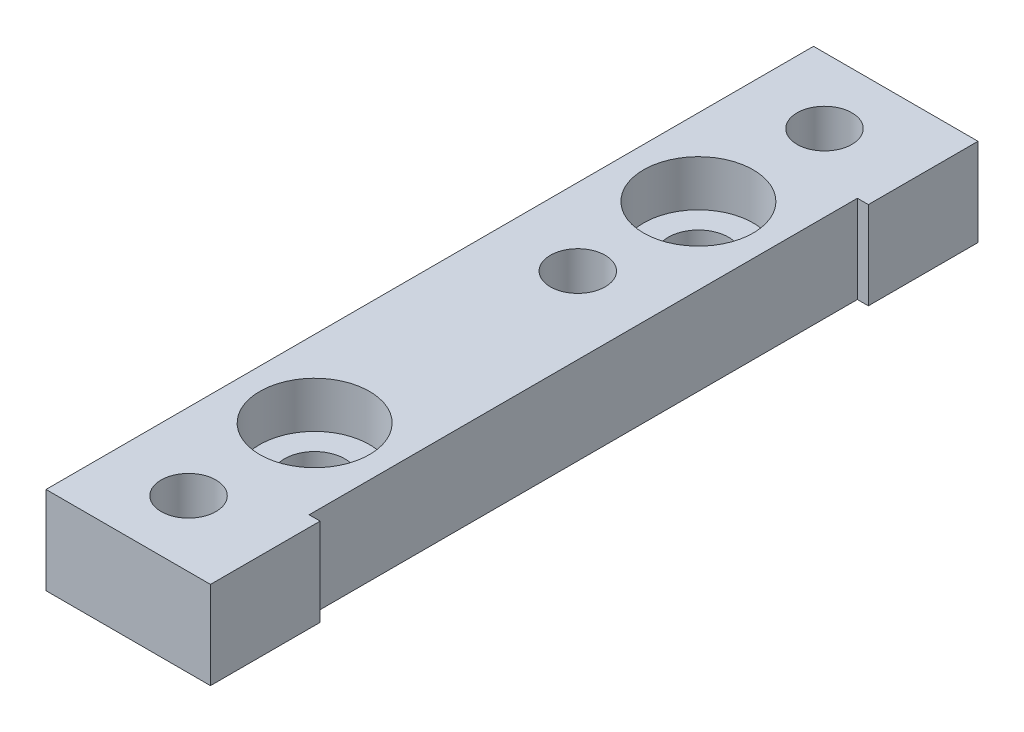
ISO-10303-21;
HEADER;
FILE_DESCRIPTION(('STEP AP214'),'2;1');
FILE_NAME('part.step','',(''),(''),'','','');
FILE_SCHEMA(('AUTOMOTIVE_DESIGN { 1 0 10303 214 1 1 1 1 }'));
ENDSEC;
DATA;
#1=APPLICATION_CONTEXT('core data for automotive mechanical design processes');
#2=APPLICATION_PROTOCOL_DEFINITION('international standard','automotive_design',2000,#1);
#3=PRODUCT_CONTEXT('',#1,'mechanical');
#4=PRODUCT('Part','Part','',(#3));
#5=PRODUCT_RELATED_PRODUCT_CATEGORY('part','',(#4));
#6=PRODUCT_DEFINITION_FORMATION('','',#4);
#7=PRODUCT_DEFINITION_CONTEXT('part definition',#1,'design');
#8=PRODUCT_DEFINITION('design','',#6,#7);
#9=PRODUCT_DEFINITION_SHAPE('','',#8);
#10=(LENGTH_UNIT() NAMED_UNIT(*) SI_UNIT(.MILLI.,.METRE.));
#11=(NAMED_UNIT(*) PLANE_ANGLE_UNIT() SI_UNIT($,.RADIAN.));
#12=(NAMED_UNIT(*) SI_UNIT($,.STERADIAN.) SOLID_ANGLE_UNIT());
#13=UNCERTAINTY_MEASURE_WITH_UNIT(LENGTH_MEASURE(1.E-05),#10,'distance_accuracy_value','');
#14=(GEOMETRIC_REPRESENTATION_CONTEXT(3) GLOBAL_UNCERTAINTY_ASSIGNED_CONTEXT((#13)) GLOBAL_UNIT_ASSIGNED_CONTEXT((#10,
#11,#12)) REPRESENTATION_CONTEXT('',''));
#15=CARTESIAN_POINT('',(0.,0.,0.));
#16=DIRECTION('',(0.,0.,1.));
#17=DIRECTION('',(1.,0.,0.));
#18=AXIS2_PLACEMENT_3D('',#15,#16,#17);
#19=CARTESIAN_POINT('',(-0.500000000000005,0.,-17.5));
#20=DIRECTION('',(0.,1.,0.));
#21=DIRECTION('',(0.,0.,1.));
#22=AXIS2_PLACEMENT_3D('',#19,#20,#21);
#23=CYLINDRICAL_SURFACE('',#22,2.75);
#24=CARTESIAN_POINT('',(-0.500000000000005,0.,-17.5));
#25=DIRECTION('',(0.,1.,0.));
#26=DIRECTION('',(0.,0.,1.));
#27=AXIS2_PLACEMENT_3D('',#24,#25,#26);
#28=CIRCLE('',#27,2.75);
#29=CARTESIAN_POINT('',(-0.500000000000005,0.,-14.75));
#30=VERTEX_POINT('',#29);
#31=EDGE_CURVE('E153',#30,#30,#28,.T.);
#32=ORIENTED_EDGE('',*,*,#31,.F.);
#33=EDGE_LOOP('',(#32));
#34=FACE_BOUND('',#33,.T.);
#35=CARTESIAN_POINT('',(-0.500000000000005,3.8,-17.5));
#36=DIRECTION('',(0.,1.,0.));
#37=DIRECTION('',(0.,0.,1.));
#38=AXIS2_PLACEMENT_3D('',#35,#36,#37);
#39=CIRCLE('',#38,2.75);
#40=CARTESIAN_POINT('',(-0.500000000000005,3.8,-14.75));
#41=VERTEX_POINT('',#40);
#42=EDGE_CURVE('E150',#41,#41,#39,.F.);
#43=ORIENTED_EDGE('',*,*,#42,.F.);
#44=EDGE_LOOP('',(#43));
#45=FACE_BOUND('',#44,.T.);
#46=ADVANCED_FACE('F33',(#34,#45),#23,.F.);
#47=CARTESIAN_POINT('',(-0.500000000000004,0.,17.5));
#48=DIRECTION('',(0.,1.,0.));
#49=DIRECTION('',(0.,0.,1.));
#50=AXIS2_PLACEMENT_3D('',#47,#48,#49);
#51=CYLINDRICAL_SURFACE('',#50,2.75);
#52=CARTESIAN_POINT('',(-0.500000000000004,0.,17.5));
#53=DIRECTION('',(0.,1.,0.));
#54=DIRECTION('',(0.,0.,1.));
#55=AXIS2_PLACEMENT_3D('',#52,#53,#54);
#56=CIRCLE('',#55,2.75);
#57=CARTESIAN_POINT('',(-0.500000000000004,0.,20.25));
#58=VERTEX_POINT('',#57);
#59=EDGE_CURVE('E157',#58,#58,#56,.T.);
#60=ORIENTED_EDGE('',*,*,#59,.F.);
#61=EDGE_LOOP('',(#60));
#62=FACE_BOUND('',#61,.T.);
#63=CARTESIAN_POINT('',(-0.500000000000004,3.8,17.5));
#64=DIRECTION('',(0.,1.,0.));
#65=DIRECTION('',(0.,0.,1.));
#66=AXIS2_PLACEMENT_3D('',#63,#64,#65);
#67=CIRCLE('',#66,2.75);
#68=CARTESIAN_POINT('',(-0.500000000000004,3.8,20.25));
#69=VERTEX_POINT('',#68);
#70=EDGE_CURVE('E148',#69,#69,#67,.F.);
#71=ORIENTED_EDGE('',*,*,#70,.F.);
#72=EDGE_LOOP('',(#71));
#73=FACE_BOUND('',#72,.T.);
#74=ADVANCED_FACE('F219',(#62,#73),#51,.F.);
#75=CARTESIAN_POINT('',(7.5,8.,-35.));
#76=DIRECTION('',(-1.,0.,0.));
#77=DIRECTION('',(0.,0.,1.));
#78=AXIS2_PLACEMENT_3D('',#75,#76,#77);
#79=PLANE('',#78);
#80=DIRECTION('',(0.,0.,-1.));
#81=VECTOR('',#80,1.);
#82=CARTESIAN_POINT('',(7.5,0.,-35.));
#83=LINE('',#82,#81);
#84=CARTESIAN_POINT('',(7.5,0.,35.));
#85=VERTEX_POINT('',#84);
#86=CARTESIAN_POINT('',(7.50000000000001,0.,25.));
#87=VERTEX_POINT('',#86);
#88=EDGE_CURVE('E128',#85,#87,#83,.T.);
#89=ORIENTED_EDGE('',*,*,#88,.T.);
#90=DIRECTION('',(0.,1.,0.));
#91=VECTOR('',#90,1.);
#92=CARTESIAN_POINT('',(7.50000000000001,0.,25.));
#93=LINE('',#92,#91);
#94=CARTESIAN_POINT('',(7.50000000000001,8.,25.));
#95=VERTEX_POINT('',#94);
#96=EDGE_CURVE('E129',#87,#95,#93,.T.);
#97=ORIENTED_EDGE('',*,*,#96,.T.);
#98=DIRECTION('',(0.,0.,-1.));
#99=VECTOR('',#98,1.);
#100=CARTESIAN_POINT('',(7.5,8.,-35.));
#101=LINE('',#100,#99);
#102=CARTESIAN_POINT('',(7.5,8.,35.));
#103=VERTEX_POINT('',#102);
#104=EDGE_CURVE('E188',#103,#95,#101,.T.);
#105=ORIENTED_EDGE('',*,*,#104,.F.);
#106=DIRECTION('',(0.,-1.,0.));
#107=VECTOR('',#106,1.);
#108=CARTESIAN_POINT('',(7.5,8.,35.));
#109=LINE('',#108,#107);
#110=EDGE_CURVE('E142',#103,#85,#109,.T.);
#111=ORIENTED_EDGE('',*,*,#110,.T.);
#112=EDGE_LOOP('',(#89,#97,#105,#111));
#113=FACE_BOUND('',#112,.T.);
#114=ADVANCED_FACE('F203',(#113),#79,.F.);
#115=CARTESIAN_POINT('',(7.5,8.,-25.));
#116=VERTEX_POINT('',#115);
#117=CARTESIAN_POINT('',(7.5,8.,-35.));
#118=VERTEX_POINT('',#117);
#119=EDGE_CURVE('E87',#116,#118,#101,.T.);
#120=ORIENTED_EDGE('',*,*,#119,.F.);
#121=DIRECTION('',(0.,1.,0.));
#122=VECTOR('',#121,1.);
#123=CARTESIAN_POINT('',(7.5,0.,-25.));
#124=LINE('',#123,#122);
#125=CARTESIAN_POINT('',(7.5,0.,-25.));
#126=VERTEX_POINT('',#125);
#127=EDGE_CURVE('E113',#126,#116,#124,.T.);
#128=ORIENTED_EDGE('',*,*,#127,.F.);
#129=CARTESIAN_POINT('',(7.5,0.,-35.));
#130=VERTEX_POINT('',#129);
#131=EDGE_CURVE('E121',#126,#130,#83,.T.);
#132=ORIENTED_EDGE('',*,*,#131,.T.);
#133=DIRECTION('',(0.,-1.,0.));
#134=VECTOR('',#133,1.);
#135=CARTESIAN_POINT('',(7.5,8.,-35.));
#136=LINE('',#135,#134);
#137=EDGE_CURVE('E11',#118,#130,#136,.T.);
#138=ORIENTED_EDGE('',*,*,#137,.F.);
#139=EDGE_LOOP('',(#120,#128,#132,#138));
#140=FACE_BOUND('',#139,.T.);
#141=ADVANCED_FACE('F35',(#140),#79,.F.);
#142=CARTESIAN_POINT('',(-7.5,8.,-35.));
#143=DIRECTION('',(0.,0.,1.));
#144=DIRECTION('',(1.,0.,0.));
#145=AXIS2_PLACEMENT_3D('',#142,#143,#144);
#146=PLANE('',#145);
#147=DIRECTION('',(-1.,0.,0.));
#148=VECTOR('',#147,1.);
#149=CARTESIAN_POINT('',(-7.5,0.,-35.));
#150=LINE('',#149,#148);
#151=CARTESIAN_POINT('',(-7.5,0.,-35.));
#152=VERTEX_POINT('',#151);
#153=EDGE_CURVE('E127',#130,#152,#150,.T.);
#154=ORIENTED_EDGE('',*,*,#153,.T.);
#155=DIRECTION('',(0.,-1.,0.));
#156=VECTOR('',#155,1.);
#157=CARTESIAN_POINT('',(-7.5,8.,-35.));
#158=LINE('',#157,#156);
#159=CARTESIAN_POINT('',(-7.5,8.,-35.));
#160=VERTEX_POINT('',#159);
#161=EDGE_CURVE('E42',#160,#152,#158,.T.);
#162=ORIENTED_EDGE('',*,*,#161,.F.);
#163=DIRECTION('',(-1.,0.,0.));
#164=VECTOR('',#163,1.);
#165=CARTESIAN_POINT('',(-7.5,8.,-35.));
#166=LINE('',#165,#164);
#167=EDGE_CURVE('E190',#118,#160,#166,.T.);
#168=ORIENTED_EDGE('',*,*,#167,.F.);
#169=ORIENTED_EDGE('',*,*,#137,.T.);
#170=EDGE_LOOP('',(#154,#162,#168,#169));
#171=FACE_BOUND('',#170,.T.);
#172=ADVANCED_FACE('F258',(#171),#146,.F.);
#173=CARTESIAN_POINT('',(-7.5,8.,-35.));
#174=DIRECTION('',(1.,0.,0.));
#175=DIRECTION('',(0.,0.,-1.));
#176=AXIS2_PLACEMENT_3D('',#173,#174,#175);
#177=PLANE('',#176);
#178=DIRECTION('',(0.,0.,1.));
#179=VECTOR('',#178,1.);
#180=CARTESIAN_POINT('',(-7.5,0.,-35.));
#181=LINE('',#180,#179);
#182=CARTESIAN_POINT('',(-7.5,0.,35.));
#183=VERTEX_POINT('',#182);
#184=EDGE_CURVE('E139',#152,#183,#181,.T.);
#185=ORIENTED_EDGE('',*,*,#184,.T.);
#186=DIRECTION('',(0.,-1.,0.));
#187=VECTOR('',#186,1.);
#188=CARTESIAN_POINT('',(-7.5,8.,35.));
#189=LINE('',#188,#187);
#190=CARTESIAN_POINT('',(-7.5,8.,35.));
#191=VERTEX_POINT('',#190);
#192=EDGE_CURVE('E144',#191,#183,#189,.T.);
#193=ORIENTED_EDGE('',*,*,#192,.F.);
#194=DIRECTION('',(0.,0.,1.));
#195=VECTOR('',#194,1.);
#196=CARTESIAN_POINT('',(-7.5,8.,-35.));
#197=LINE('',#196,#195);
#198=EDGE_CURVE('E191',#160,#191,#197,.T.);
#199=ORIENTED_EDGE('',*,*,#198,.F.);
#200=ORIENTED_EDGE('',*,*,#161,.T.);
#201=EDGE_LOOP('',(#185,#193,#199,#200));
#202=FACE_BOUND('',#201,.T.);
#203=ADVANCED_FACE('F198',(#202),#177,.F.);
#204=CARTESIAN_POINT('',(-7.5,8.,35.));
#205=DIRECTION('',(0.,0.,-1.));
#206=DIRECTION('',(-1.,0.,0.));
#207=AXIS2_PLACEMENT_3D('',#204,#205,#206);
#208=PLANE('',#207);
#209=DIRECTION('',(1.,0.,0.));
#210=VECTOR('',#209,1.);
#211=CARTESIAN_POINT('',(-7.5,0.,35.));
#212=LINE('',#211,#210);
#213=EDGE_CURVE('E80',#183,#85,#212,.T.);
#214=ORIENTED_EDGE('',*,*,#213,.T.);
#215=ORIENTED_EDGE('',*,*,#110,.F.);
#216=DIRECTION('',(1.,0.,0.));
#217=VECTOR('',#216,1.);
#218=CARTESIAN_POINT('',(-7.5,8.,35.));
#219=LINE('',#218,#217);
#220=EDGE_CURVE('E59',#191,#103,#219,.T.);
#221=ORIENTED_EDGE('',*,*,#220,.F.);
#222=ORIENTED_EDGE('',*,*,#192,.T.);
#223=EDGE_LOOP('',(#214,#215,#221,#222));
#224=FACE_BOUND('',#223,.T.);
#225=ADVANCED_FACE('F199',(#224),#208,.F.);
#226=CARTESIAN_POINT('',(0.,8.,0.));
#227=DIRECTION('',(0.,1.,0.));
#228=DIRECTION('',(0.,0.,1.));
#229=AXIS2_PLACEMENT_3D('',#226,#227,#228);
#230=PLANE('',#229);
#231=CARTESIAN_POINT('',(-0.500000000000004,8.,-6.5));
#232=DIRECTION('',(0.,1.,0.));
#233=DIRECTION('',(0.,0.,1.));
#234=AXIS2_PLACEMENT_3D('',#231,#232,#233);
#235=CIRCLE('',#234,2.5);
#236=CARTESIAN_POINT('',(-0.500000000000004,8.,-4.));
#237=VERTEX_POINT('',#236);
#238=EDGE_CURVE('E386',#237,#237,#235,.T.);
#239=ORIENTED_EDGE('',*,*,#238,.F.);
#240=EDGE_LOOP('',(#239));
#241=FACE_BOUND('',#240,.T.);
#242=CARTESIAN_POINT('',(-0.500000000000005,8.,-17.5));
#243=DIRECTION('',(0.,1.,0.));
#244=DIRECTION('',(0.,0.,1.));
#245=AXIS2_PLACEMENT_3D('',#242,#243,#244);
#246=CIRCLE('',#245,5.);
#247=CARTESIAN_POINT('',(-0.500000000000005,8.,-12.5));
#248=VERTEX_POINT('',#247);
#249=EDGE_CURVE('E396',#248,#248,#246,.T.);
#250=ORIENTED_EDGE('',*,*,#249,.F.);
#251=EDGE_LOOP('',(#250));
#252=FACE_BOUND('',#251,.T.);
#253=CARTESIAN_POINT('',(-0.500000000000004,8.,17.5));
#254=DIRECTION('',(0.,1.,0.));
#255=DIRECTION('',(0.,0.,1.));
#256=AXIS2_PLACEMENT_3D('',#253,#254,#255);
#257=CIRCLE('',#256,5.);
#258=CARTESIAN_POINT('',(-0.500000000000004,8.,22.5));
#259=VERTEX_POINT('',#258);
#260=EDGE_CURVE('E389',#259,#259,#257,.T.);
#261=ORIENTED_EDGE('',*,*,#260,.F.);
#262=EDGE_LOOP('',(#261));
#263=FACE_BOUND('',#262,.T.);
#264=CARTESIAN_POINT('',(-0.500000000000004,8.,29.));
#265=DIRECTION('',(0.,1.,0.));
#266=DIRECTION('',(0.,0.,1.));
#267=AXIS2_PLACEMENT_3D('',#264,#265,#266);
#268=CIRCLE('',#267,2.5);
#269=CARTESIAN_POINT('',(-0.500000000000004,8.,31.5));
#270=VERTEX_POINT('',#269);
#271=EDGE_CURVE('E170',#270,#270,#268,.T.);
#272=ORIENTED_EDGE('',*,*,#271,.F.);
#273=EDGE_LOOP('',(#272));
#274=FACE_BOUND('',#273,.T.);
#275=CARTESIAN_POINT('',(-0.500000000000004,8.,-29.));
#276=DIRECTION('',(0.,1.,0.));
#277=DIRECTION('',(0.,0.,1.));
#278=AXIS2_PLACEMENT_3D('',#275,#276,#277);
#279=CIRCLE('',#278,2.5);
#280=CARTESIAN_POINT('',(-0.500000000000004,8.,-26.5));
#281=VERTEX_POINT('',#280);
#282=EDGE_CURVE('E162',#281,#281,#279,.T.);
#283=ORIENTED_EDGE('',*,*,#282,.F.);
#284=EDGE_LOOP('',(#283));
#285=FACE_BOUND('',#284,.T.);
#286=DIRECTION('',(1.,0.,0.));
#287=VECTOR('',#286,1.);
#288=CARTESIAN_POINT('',(7.50000000000001,8.,25.));
#289=LINE('',#288,#287);
#290=CARTESIAN_POINT('',(6.50000000000001,8.,25.));
#291=VERTEX_POINT('',#290);
#292=EDGE_CURVE('E117',#291,#95,#289,.T.);
#293=ORIENTED_EDGE('',*,*,#292,.F.);
#294=DIRECTION('',(0.,0.,1.));
#295=VECTOR('',#294,1.);
#296=CARTESIAN_POINT('',(6.5,8.,-25.));
#297=LINE('',#296,#295);
#298=CARTESIAN_POINT('',(6.5,8.,-25.));
#299=VERTEX_POINT('',#298);
#300=EDGE_CURVE('E182',#299,#291,#297,.T.);
#301=ORIENTED_EDGE('',*,*,#300,.F.);
#302=DIRECTION('',(-1.,0.,0.));
#303=VECTOR('',#302,1.);
#304=CARTESIAN_POINT('',(7.5,8.,-25.));
#305=LINE('',#304,#303);
#306=EDGE_CURVE('E169',#116,#299,#305,.T.);
#307=ORIENTED_EDGE('',*,*,#306,.F.);
#308=ORIENTED_EDGE('',*,*,#119,.T.);
#309=ORIENTED_EDGE('',*,*,#167,.T.);
#310=ORIENTED_EDGE('',*,*,#198,.T.);
#311=ORIENTED_EDGE('',*,*,#220,.T.);
#312=ORIENTED_EDGE('',*,*,#104,.T.);
#313=EDGE_LOOP('',(#293,#301,#307,#308,#309,#310,#311,#312));
#314=FACE_BOUND('',#313,.T.);
#315=ADVANCED_FACE('F195',(#241,#252,#263,#274,#285,#314),#230,.T.);
#316=CARTESIAN_POINT('',(0.,0.,0.));
#317=DIRECTION('',(0.,1.,0.));
#318=DIRECTION('',(0.,0.,1.));
#319=AXIS2_PLACEMENT_3D('',#316,#317,#318);
#320=PLANE('',#319);
#321=CARTESIAN_POINT('',(-0.500000000000004,0.,-6.5));
#322=DIRECTION('',(0.,1.,0.));
#323=DIRECTION('',(0.,0.,1.));
#324=AXIS2_PLACEMENT_3D('',#321,#322,#323);
#325=CIRCLE('',#324,2.5);
#326=CARTESIAN_POINT('',(-0.500000000000004,0.,-4.));
#327=VERTEX_POINT('',#326);
#328=EDGE_CURVE('E37',#327,#327,#325,.T.);
#329=ORIENTED_EDGE('',*,*,#328,.T.);
#330=EDGE_LOOP('',(#329));
#331=FACE_BOUND('',#330,.T.);
#332=ORIENTED_EDGE('',*,*,#59,.T.);
#333=EDGE_LOOP('',(#332));
#334=FACE_BOUND('',#333,.T.);
#335=ORIENTED_EDGE('',*,*,#31,.T.);
#336=EDGE_LOOP('',(#335));
#337=FACE_BOUND('',#336,.T.);
#338=CARTESIAN_POINT('',(-0.500000000000004,0.,29.));
#339=DIRECTION('',(0.,1.,0.));
#340=DIRECTION('',(0.,0.,1.));
#341=AXIS2_PLACEMENT_3D('',#338,#339,#340);
#342=CIRCLE('',#341,2.5);
#343=CARTESIAN_POINT('',(-0.500000000000004,0.,31.5));
#344=VERTEX_POINT('',#343);
#345=EDGE_CURVE('E166',#344,#344,#342,.T.);
#346=ORIENTED_EDGE('',*,*,#345,.T.);
#347=EDGE_LOOP('',(#346));
#348=FACE_BOUND('',#347,.T.);
#349=CARTESIAN_POINT('',(-0.500000000000004,0.,-29.));
#350=DIRECTION('',(0.,1.,0.));
#351=DIRECTION('',(0.,0.,1.));
#352=AXIS2_PLACEMENT_3D('',#349,#350,#351);
#353=CIRCLE('',#352,2.5);
#354=CARTESIAN_POINT('',(-0.500000000000004,0.,-26.5));
#355=VERTEX_POINT('',#354);
#356=EDGE_CURVE('E173',#355,#355,#353,.T.);
#357=ORIENTED_EDGE('',*,*,#356,.T.);
#358=EDGE_LOOP('',(#357));
#359=FACE_BOUND('',#358,.T.);
#360=DIRECTION('',(0.,0.,1.));
#361=VECTOR('',#360,1.);
#362=CARTESIAN_POINT('',(6.5,0.,-25.));
#363=LINE('',#362,#361);
#364=CARTESIAN_POINT('',(6.5,0.,-25.));
#365=VERTEX_POINT('',#364);
#366=CARTESIAN_POINT('',(6.50000000000001,0.,25.));
#367=VERTEX_POINT('',#366);
#368=EDGE_CURVE('E50',#365,#367,#363,.T.);
#369=ORIENTED_EDGE('',*,*,#368,.T.);
#370=DIRECTION('',(1.,0.,0.));
#371=VECTOR('',#370,1.);
#372=CARTESIAN_POINT('',(7.50000000000001,0.,25.));
#373=LINE('',#372,#371);
#374=EDGE_CURVE('E123',#367,#87,#373,.T.);
#375=ORIENTED_EDGE('',*,*,#374,.T.);
#376=ORIENTED_EDGE('',*,*,#88,.F.);
#377=ORIENTED_EDGE('',*,*,#213,.F.);
#378=ORIENTED_EDGE('',*,*,#184,.F.);
#379=ORIENTED_EDGE('',*,*,#153,.F.);
#380=ORIENTED_EDGE('',*,*,#131,.F.);
#381=DIRECTION('',(-1.,0.,0.));
#382=VECTOR('',#381,1.);
#383=CARTESIAN_POINT('',(7.5,0.,-25.));
#384=LINE('',#383,#382);
#385=EDGE_CURVE('E109',#126,#365,#384,.T.);
#386=ORIENTED_EDGE('',*,*,#385,.T.);
#387=EDGE_LOOP('',(#369,#375,#376,#377,#378,#379,#380,#386));
#388=FACE_BOUND('',#387,.T.);
#389=ADVANCED_FACE('F125',(#331,#334,#337,#348,#359,#388),#320,.F.);
#390=CARTESIAN_POINT('',(7.50000000000001,0.,25.));
#391=DIRECTION('',(0.,0.,1.));
#392=DIRECTION('',(1.,0.,0.));
#393=AXIS2_PLACEMENT_3D('',#390,#391,#392);
#394=PLANE('',#393);
#395=ORIENTED_EDGE('',*,*,#292,.T.);
#396=ORIENTED_EDGE('',*,*,#96,.F.);
#397=ORIENTED_EDGE('',*,*,#374,.F.);
#398=DIRECTION('',(0.,1.,0.));
#399=VECTOR('',#398,1.);
#400=CARTESIAN_POINT('',(6.50000000000001,0.,25.));
#401=LINE('',#400,#399);
#402=EDGE_CURVE('E133',#367,#291,#401,.T.);
#403=ORIENTED_EDGE('',*,*,#402,.T.);
#404=EDGE_LOOP('',(#395,#396,#397,#403));
#405=FACE_BOUND('',#404,.T.);
#406=ADVANCED_FACE('F206',(#405),#394,.F.);
#407=CARTESIAN_POINT('',(6.5,0.,-25.));
#408=DIRECTION('',(-1.,0.,0.));
#409=DIRECTION('',(0.,0.,1.));
#410=AXIS2_PLACEMENT_3D('',#407,#408,#409);
#411=PLANE('',#410);
#412=ORIENTED_EDGE('',*,*,#300,.T.);
#413=ORIENTED_EDGE('',*,*,#402,.F.);
#414=ORIENTED_EDGE('',*,*,#368,.F.);
#415=DIRECTION('',(0.,1.,0.));
#416=VECTOR('',#415,1.);
#417=CARTESIAN_POINT('',(6.5,0.,-25.));
#418=LINE('',#417,#416);
#419=EDGE_CURVE('E114',#365,#299,#418,.T.);
#420=ORIENTED_EDGE('',*,*,#419,.T.);
#421=EDGE_LOOP('',(#412,#413,#414,#420));
#422=FACE_BOUND('',#421,.T.);
#423=ADVANCED_FACE('F208',(#422),#411,.F.);
#424=CARTESIAN_POINT('',(7.5,0.,-25.));
#425=DIRECTION('',(0.,0.,-1.));
#426=DIRECTION('',(-1.,0.,0.));
#427=AXIS2_PLACEMENT_3D('',#424,#425,#426);
#428=PLANE('',#427);
#429=ORIENTED_EDGE('',*,*,#306,.T.);
#430=ORIENTED_EDGE('',*,*,#419,.F.);
#431=ORIENTED_EDGE('',*,*,#385,.F.);
#432=ORIENTED_EDGE('',*,*,#127,.T.);
#433=EDGE_LOOP('',(#429,#430,#431,#432));
#434=FACE_BOUND('',#433,.T.);
#435=ADVANCED_FACE('F112',(#434),#428,.F.);
#436=CARTESIAN_POINT('',(-0.500000000000004,0.,-29.));
#437=DIRECTION('',(0.,1.,0.));
#438=DIRECTION('',(0.,0.,1.));
#439=AXIS2_PLACEMENT_3D('',#436,#437,#438);
#440=CYLINDRICAL_SURFACE('',#439,2.5);
#441=ORIENTED_EDGE('',*,*,#356,.F.);
#442=EDGE_LOOP('',(#441));
#443=FACE_BOUND('',#442,.T.);
#444=ORIENTED_EDGE('',*,*,#282,.T.);
#445=EDGE_LOOP('',(#444));
#446=FACE_BOUND('',#445,.T.);
#447=ADVANCED_FACE('F215',(#443,#446),#440,.F.);
#448=CARTESIAN_POINT('',(-0.500000000000004,0.,29.));
#449=DIRECTION('',(0.,1.,0.));
#450=DIRECTION('',(0.,0.,1.));
#451=AXIS2_PLACEMENT_3D('',#448,#449,#450);
#452=CYLINDRICAL_SURFACE('',#451,2.5);
#453=ORIENTED_EDGE('',*,*,#345,.F.);
#454=EDGE_LOOP('',(#453));
#455=FACE_BOUND('',#454,.T.);
#456=ORIENTED_EDGE('',*,*,#271,.T.);
#457=EDGE_LOOP('',(#456));
#458=FACE_BOUND('',#457,.T.);
#459=ADVANCED_FACE('F230',(#455,#458),#452,.F.);
#460=CARTESIAN_POINT('',(-0.500000000000004,3.8,17.5));
#461=DIRECTION('',(0.,1.,0.));
#462=DIRECTION('',(0.,0.,1.));
#463=AXIS2_PLACEMENT_3D('',#460,#461,#462);
#464=PLANE('',#463);
#465=CARTESIAN_POINT('',(-0.500000000000004,3.8,17.5));
#466=DIRECTION('',(0.,1.,0.));
#467=DIRECTION('',(0.,0.,1.));
#468=AXIS2_PLACEMENT_3D('',#465,#466,#467);
#469=CIRCLE('',#468,5.);
#470=CARTESIAN_POINT('',(-0.500000000000004,3.8,22.5));
#471=VERTEX_POINT('',#470);
#472=EDGE_CURVE('E391',#471,#471,#469,.T.);
#473=ORIENTED_EDGE('',*,*,#472,.T.);
#474=EDGE_LOOP('',(#473));
#475=FACE_BOUND('',#474,.T.);
#476=ORIENTED_EDGE('',*,*,#70,.T.);
#477=EDGE_LOOP('',(#476));
#478=FACE_BOUND('',#477,.T.);
#479=ADVANCED_FACE('F233',(#475,#478),#464,.T.);
#480=CARTESIAN_POINT('',(-0.500000000000004,3.8,17.5));
#481=DIRECTION('',(0.,1.,0.));
#482=DIRECTION('',(0.,0.,1.));
#483=AXIS2_PLACEMENT_3D('',#480,#481,#482);
#484=CYLINDRICAL_SURFACE('',#483,5.);
#485=ORIENTED_EDGE('',*,*,#472,.F.);
#486=EDGE_LOOP('',(#485));
#487=FACE_BOUND('',#486,.T.);
#488=ORIENTED_EDGE('',*,*,#260,.T.);
#489=EDGE_LOOP('',(#488));
#490=FACE_BOUND('',#489,.T.);
#491=ADVANCED_FACE('F287',(#487,#490),#484,.F.);
#492=CARTESIAN_POINT('',(-0.500000000000005,3.8,-17.5));
#493=DIRECTION('',(0.,1.,0.));
#494=DIRECTION('',(0.,0.,1.));
#495=AXIS2_PLACEMENT_3D('',#492,#493,#494);
#496=PLANE('',#495);
#497=CARTESIAN_POINT('',(-0.500000000000005,3.8,-17.5));
#498=DIRECTION('',(0.,1.,0.));
#499=DIRECTION('',(0.,0.,1.));
#500=AXIS2_PLACEMENT_3D('',#497,#498,#499);
#501=CIRCLE('',#500,5.);
#502=CARTESIAN_POINT('',(-0.500000000000005,3.8,-12.5));
#503=VERTEX_POINT('',#502);
#504=EDGE_CURVE('E151',#503,#503,#501,.T.);
#505=ORIENTED_EDGE('',*,*,#504,.T.);
#506=EDGE_LOOP('',(#505));
#507=FACE_BOUND('',#506,.T.);
#508=ORIENTED_EDGE('',*,*,#42,.T.);
#509=EDGE_LOOP('',(#508));
#510=FACE_BOUND('',#509,.T.);
#511=ADVANCED_FACE('F297',(#507,#510),#496,.T.);
#512=CARTESIAN_POINT('',(-0.500000000000005,3.8,-17.5));
#513=DIRECTION('',(0.,1.,0.));
#514=DIRECTION('',(0.,0.,1.));
#515=AXIS2_PLACEMENT_3D('',#512,#513,#514);
#516=CYLINDRICAL_SURFACE('',#515,5.);
#517=ORIENTED_EDGE('',*,*,#504,.F.);
#518=EDGE_LOOP('',(#517));
#519=FACE_BOUND('',#518,.T.);
#520=ORIENTED_EDGE('',*,*,#249,.T.);
#521=EDGE_LOOP('',(#520));
#522=FACE_BOUND('',#521,.T.);
#523=ADVANCED_FACE('F305',(#519,#522),#516,.F.);
#524=CARTESIAN_POINT('',(-0.500000000000004,-64.2,-6.5));
#525=DIRECTION('',(0.,1.,0.));
#526=DIRECTION('',(0.,0.,1.));
#527=AXIS2_PLACEMENT_3D('',#524,#525,#526);
#528=CYLINDRICAL_SURFACE('',#527,2.5);
#529=ORIENTED_EDGE('',*,*,#238,.T.);
#530=EDGE_LOOP('',(#529));
#531=FACE_BOUND('',#530,.T.);
#532=ORIENTED_EDGE('',*,*,#328,.F.);
#533=EDGE_LOOP('',(#532));
#534=FACE_BOUND('',#533,.T.);
#535=ADVANCED_FACE('F314',(#531,#534),#528,.F.);
#536=CLOSED_SHELL('',(#46,#74,#114,#141,#172,#203,#225,#315,#389,#406,#423,#435,#447,#459,#479,
#491,#511,#523,#535));
#537=MANIFOLD_SOLID_BREP('B2',#536);
#538=ADVANCED_BREP_SHAPE_REPRESENTATION('',(#18,#537),#14);
#539=SHAPE_DEFINITION_REPRESENTATION(#9,#538);
ENDSEC;
END-ISO-10303-21;
